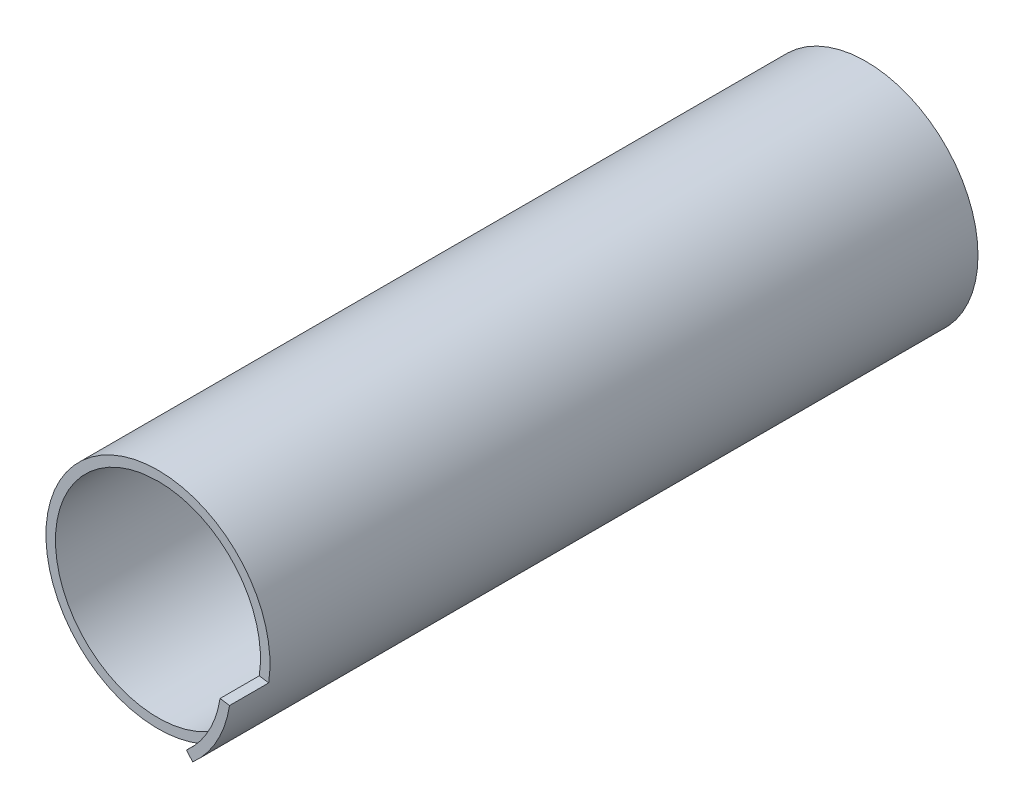
ISO-10303-21;
HEADER;
FILE_DESCRIPTION(('STEP AP214'),'2;1');
FILE_NAME('part.step','',(''),(''),'','','');
FILE_SCHEMA(('AUTOMOTIVE_DESIGN { 1 0 10303 214 1 1 1 1 }'));
ENDSEC;
DATA;
#1=APPLICATION_CONTEXT('core data for automotive mechanical design processes');
#2=APPLICATION_PROTOCOL_DEFINITION('international standard','automotive_design',2000,#1);
#3=PRODUCT_CONTEXT('',#1,'mechanical');
#4=PRODUCT('Part','Part','',(#3));
#5=PRODUCT_RELATED_PRODUCT_CATEGORY('part','',(#4));
#6=PRODUCT_DEFINITION_FORMATION('','',#4);
#7=PRODUCT_DEFINITION_CONTEXT('part definition',#1,'design');
#8=PRODUCT_DEFINITION('design','',#6,#7);
#9=PRODUCT_DEFINITION_SHAPE('','',#8);
#10=(LENGTH_UNIT() NAMED_UNIT(*) SI_UNIT(.MILLI.,.METRE.));
#11=(NAMED_UNIT(*) PLANE_ANGLE_UNIT() SI_UNIT($,.RADIAN.));
#12=(NAMED_UNIT(*) SI_UNIT($,.STERADIAN.) SOLID_ANGLE_UNIT());
#13=UNCERTAINTY_MEASURE_WITH_UNIT(LENGTH_MEASURE(1.E-05),#10,'distance_accuracy_value','');
#14=(GEOMETRIC_REPRESENTATION_CONTEXT(3) GLOBAL_UNCERTAINTY_ASSIGNED_CONTEXT((#13)) GLOBAL_UNIT_ASSIGNED_CONTEXT((#10,
#11,#12)) REPRESENTATION_CONTEXT('',''));
#15=CARTESIAN_POINT('',(0.,0.,0.));
#16=DIRECTION('',(0.,0.,1.));
#17=DIRECTION('',(1.,0.,0.));
#18=AXIS2_PLACEMENT_3D('',#15,#16,#17);
#19=CARTESIAN_POINT('',(0.,0.,0.));
#20=DIRECTION('',(0.,0.,-1.));
#21=DIRECTION('',(-1.,0.,0.));
#22=AXIS2_PLACEMENT_3D('',#19,#20,#21);
#23=PLANE('',#22);
#24=CARTESIAN_POINT('',(0.,0.,0.));
#25=DIRECTION('',(0.,0.,1.));
#26=DIRECTION('',(-1.,0.,0.));
#27=AXIS2_PLACEMENT_3D('',#24,#25,#26);
#28=CIRCLE('',#27,5.);
#29=CARTESIAN_POINT('',(-5.,0.,0.));
#30=VERTEX_POINT('',#29);
#31=CARTESIAN_POINT('',(5.,0.,0.));
#32=VERTEX_POINT('',#31);
#33=EDGE_CURVE('E102',#30,#32,#28,.T.);
#34=ORIENTED_EDGE('',*,*,#33,.F.);
#35=DIRECTION('',(0.,-1.,0.));
#36=VECTOR('',#35,1.);
#37=CARTESIAN_POINT('',(-5.,0.,0.));
#38=LINE('',#37,#36);
#39=CARTESIAN_POINT('',(-5.,16.5617028110035,0.));
#40=VERTEX_POINT('',#39);
#41=EDGE_CURVE('E56',#40,#30,#38,.T.);
#42=ORIENTED_EDGE('',*,*,#41,.F.);
#43=CARTESIAN_POINT('',(0.,0.,0.));
#44=DIRECTION('',(0.,0.,1.));
#45=DIRECTION('',(1.,0.,0.));
#46=AXIS2_PLACEMENT_3D('',#43,#44,#45);
#47=CIRCLE('',#46,17.3);
#48=CARTESIAN_POINT('',(5.,16.5617028110035,0.));
#49=VERTEX_POINT('',#48);
#50=EDGE_CURVE('E103',#49,#40,#47,.T.);
#51=ORIENTED_EDGE('',*,*,#50,.F.);
#52=DIRECTION('',(0.,1.,0.));
#53=VECTOR('',#52,1.);
#54=CARTESIAN_POINT('',(5.,0.,0.));
#55=LINE('',#54,#53);
#56=EDGE_CURVE('E92',#32,#49,#55,.T.);
#57=ORIENTED_EDGE('',*,*,#56,.F.);
#58=EDGE_LOOP('',(#34,#42,#51,#57));
#59=FACE_BOUND('',#58,.T.);
#60=CARTESIAN_POINT('',(0.,0.,0.));
#61=DIRECTION('',(0.,0.,1.));
#62=DIRECTION('',(1.,0.,0.));
#63=AXIS2_PLACEMENT_3D('',#60,#61,#62);
#64=CIRCLE('',#63,2.99999999999862);
#65=CARTESIAN_POINT('',(2.99999999999862,0.,0.));
#66=VERTEX_POINT('',#65);
#67=EDGE_CURVE('E115',#66,#66,#64,.T.);
#68=ORIENTED_EDGE('',*,*,#67,.T.);
#69=EDGE_LOOP('',(#68));
#70=FACE_BOUND('',#69,.T.);
#71=ADVANCED_FACE('F47',(#59,#70),#23,.T.);
#72=CARTESIAN_POINT('',(0.,0.,83.4395171801736));
#73=DIRECTION('',(0.,0.,-1.));
#74=DIRECTION('',(-1.,0.,0.));
#75=AXIS2_PLACEMENT_3D('',#72,#73,#74);
#76=CYLINDRICAL_SURFACE('',#75,5.);
#77=DIRECTION('',(0.,0.,-1.));
#78=VECTOR('',#77,1.);
#79=CARTESIAN_POINT('',(5.,0.,83.4395171801736));
#80=LINE('',#79,#78);
#81=CARTESIAN_POINT('',(5.,0.,58.6));
#82=VERTEX_POINT('',#81);
#83=EDGE_CURVE('E89',#82,#32,#80,.T.);
#84=ORIENTED_EDGE('',*,*,#83,.F.);
#85=CARTESIAN_POINT('',(0.,0.,58.6));
#86=DIRECTION('',(0.,0.,-1.));
#87=DIRECTION('',(-1.,0.,0.));
#88=AXIS2_PLACEMENT_3D('',#85,#86,#87);
#89=CIRCLE('',#88,5.);
#90=CARTESIAN_POINT('',(-5.,0.,58.6));
#91=VERTEX_POINT('',#90);
#92=EDGE_CURVE('E64',#82,#91,#89,.T.);
#93=ORIENTED_EDGE('',*,*,#92,.T.);
#94=DIRECTION('',(0.,0.,-1.));
#95=VECTOR('',#94,1.);
#96=CARTESIAN_POINT('',(-5.,0.,83.4395171801736));
#97=LINE('',#96,#95);
#98=EDGE_CURVE('E108',#91,#30,#97,.T.);
#99=ORIENTED_EDGE('',*,*,#98,.T.);
#100=ORIENTED_EDGE('',*,*,#33,.T.);
#101=EDGE_LOOP('',(#84,#93,#99,#100));
#102=FACE_BOUND('',#101,.T.);
#103=ADVANCED_FACE('F106',(#102),#76,.T.);
#104=CARTESIAN_POINT('',(5.,0.,83.4395171801736));
#105=DIRECTION('',(-1.,0.,0.));
#106=DIRECTION('',(0.,-1.,0.));
#107=AXIS2_PLACEMENT_3D('',#104,#105,#106);
#108=PLANE('',#107);
#109=DIRECTION('',(0.,0.,-1.));
#110=VECTOR('',#109,1.);
#111=CARTESIAN_POINT('',(5.,16.5617028110035,83.4395171801736));
#112=LINE('',#111,#110);
#113=CARTESIAN_POINT('',(5.,16.5617028110035,58.6));
#114=VERTEX_POINT('',#113);
#115=EDGE_CURVE('E84',#114,#49,#112,.T.);
#116=ORIENTED_EDGE('',*,*,#115,.F.);
#117=DIRECTION('',(0.,-1.,0.));
#118=VECTOR('',#117,1.);
#119=CARTESIAN_POINT('',(5.,0.,58.6));
#120=LINE('',#119,#118);
#121=EDGE_CURVE('E94',#114,#82,#120,.T.);
#122=ORIENTED_EDGE('',*,*,#121,.T.);
#123=ORIENTED_EDGE('',*,*,#83,.T.);
#124=ORIENTED_EDGE('',*,*,#56,.T.);
#125=EDGE_LOOP('',(#116,#122,#123,#124));
#126=FACE_BOUND('',#125,.T.);
#127=ADVANCED_FACE('F91',(#126),#108,.F.);
#128=CARTESIAN_POINT('',(0.,0.,83.4395171801736));
#129=DIRECTION('',(0.,0.,-1.));
#130=DIRECTION('',(-1.,0.,0.));
#131=AXIS2_PLACEMENT_3D('',#128,#129,#130);
#132=CYLINDRICAL_SURFACE('',#131,17.3);
#133=DIRECTION('',(0.,0.,-1.));
#134=VECTOR('',#133,1.);
#135=CARTESIAN_POINT('',(-5.,16.5617028110035,83.4395171801736));
#136=LINE('',#135,#134);
#137=CARTESIAN_POINT('',(-5.,16.5617028110035,58.6));
#138=VERTEX_POINT('',#137);
#139=EDGE_CURVE('E119',#138,#40,#136,.T.);
#140=ORIENTED_EDGE('',*,*,#139,.F.);
#141=CARTESIAN_POINT('',(0.,0.,58.6));
#142=DIRECTION('',(0.,0.,-1.));
#143=DIRECTION('',(-1.,0.,0.));
#144=AXIS2_PLACEMENT_3D('',#141,#142,#143);
#145=CIRCLE('',#144,17.3);
#146=EDGE_CURVE('E104',#138,#114,#145,.T.);
#147=ORIENTED_EDGE('',*,*,#146,.T.);
#148=ORIENTED_EDGE('',*,*,#115,.T.);
#149=ORIENTED_EDGE('',*,*,#50,.T.);
#150=EDGE_LOOP('',(#140,#147,#148,#149));
#151=FACE_BOUND('',#150,.T.);
#152=ADVANCED_FACE('F128',(#151),#132,.T.);
#153=CARTESIAN_POINT('',(-5.,0.,83.4395171801736));
#154=DIRECTION('',(1.,0.,0.));
#155=DIRECTION('',(0.,1.,0.));
#156=AXIS2_PLACEMENT_3D('',#153,#154,#155);
#157=PLANE('',#156);
#158=ORIENTED_EDGE('',*,*,#98,.F.);
#159=DIRECTION('',(0.,1.,0.));
#160=VECTOR('',#159,1.);
#161=CARTESIAN_POINT('',(-5.,0.,58.6));
#162=LINE('',#161,#160);
#163=EDGE_CURVE('E120',#91,#138,#162,.T.);
#164=ORIENTED_EDGE('',*,*,#163,.T.);
#165=ORIENTED_EDGE('',*,*,#139,.T.);
#166=ORIENTED_EDGE('',*,*,#41,.T.);
#167=EDGE_LOOP('',(#158,#164,#165,#166));
#168=FACE_BOUND('',#167,.T.);
#169=ADVANCED_FACE('F127',(#168),#157,.F.);
#170=CARTESIAN_POINT('',(0.,0.,83.4395171801736));
#171=DIRECTION('',(0.,0.,-1.));
#172=DIRECTION('',(-1.,0.,0.));
#173=AXIS2_PLACEMENT_3D('',#170,#171,#172);
#174=CYLINDRICAL_SURFACE('',#173,2.99999999999862);
#175=CARTESIAN_POINT('',(0.,0.,58.6));
#176=DIRECTION('',(0.,0.,-1.));
#177=DIRECTION('',(-1.,0.,0.));
#178=AXIS2_PLACEMENT_3D('',#175,#176,#177);
#179=CIRCLE('',#178,2.99999999999862);
#180=CARTESIAN_POINT('',(-2.99999999999862,0.,58.6));
#181=VERTEX_POINT('',#180);
#182=EDGE_CURVE('E13',#181,#181,#179,.T.);
#183=ORIENTED_EDGE('',*,*,#182,.F.);
#184=EDGE_LOOP('',(#183));
#185=FACE_BOUND('',#184,.T.);
#186=ORIENTED_EDGE('',*,*,#67,.F.);
#187=EDGE_LOOP('',(#186));
#188=FACE_BOUND('',#187,.T.);
#189=ADVANCED_FACE('F130',(#185,#188),#174,.F.);
#190=CARTESIAN_POINT('',(0.,0.,58.6));
#191=DIRECTION('',(0.,0.,-1.));
#192=DIRECTION('',(-1.,0.,0.));
#193=AXIS2_PLACEMENT_3D('',#190,#191,#192);
#194=PLANE('',#193);
#195=ORIENTED_EDGE('',*,*,#182,.T.);
#196=EDGE_LOOP('',(#195));
#197=FACE_BOUND('',#196,.T.);
#198=ORIENTED_EDGE('',*,*,#121,.F.);
#199=ORIENTED_EDGE('',*,*,#146,.F.);
#200=ORIENTED_EDGE('',*,*,#163,.F.);
#201=ORIENTED_EDGE('',*,*,#92,.F.);
#202=EDGE_LOOP('',(#198,#199,#200,#201));
#203=FACE_BOUND('',#202,.T.);
#204=ADVANCED_FACE('F49',(#197,#203),#194,.F.);
#205=CLOSED_SHELL('',(#71,#103,#127,#152,#169,#189,#204));
#206=MANIFOLD_SOLID_BREP('B2',#205);
#207=CARTESIAN_POINT('',(-7.42569141893252,8.1153624041562,126.4));
#208=DIRECTION('',(0.,0.,-1.));
#209=DIRECTION('',(-1.,0.,0.));
#210=AXIS2_PLACEMENT_3D('',#207,#208,#209);
#211=CYLINDRICAL_SURFACE('',#210,6.);
#212=CARTESIAN_POINT('',(-7.42569141893252,8.1153624041562,67.4));
#213=DIRECTION('',(0.,0.,-1.));
#214=DIRECTION('',(-1.,0.,0.));
#215=AXIS2_PLACEMENT_3D('',#212,#213,#214);
#216=CIRCLE('',#215,6.);
#217=CARTESIAN_POINT('',(-1.50631490724211,9.09565915149749,67.4));
#218=VERTEX_POINT('',#217);
#219=CARTESIAN_POINT('',(-3.37531428133296,3.68880109279827,67.4));
#220=VERTEX_POINT('',#219);
#221=EDGE_CURVE('E317',#218,#220,#216,.T.);
#222=ORIENTED_EDGE('',*,*,#221,.F.);
#223=DIRECTION('',(0.,0.,-1.));
#224=VECTOR('',#223,1.);
#225=CARTESIAN_POINT('',(-1.50631490724211,9.09565915149749,126.4));
#226=LINE('',#225,#224);
#227=CARTESIAN_POINT('',(-1.50631490724211,9.09565915149749,59.));
#228=VERTEX_POINT('',#227);
#229=EDGE_CURVE('E350',#218,#228,#226,.T.);
#230=ORIENTED_EDGE('',*,*,#229,.T.);
#231=CARTESIAN_POINT('',(-7.42569141893252,8.1153624041562,59.));
#232=DIRECTION('',(0.,0.,-1.));
#233=DIRECTION('',(-1.,0.,0.));
#234=AXIS2_PLACEMENT_3D('',#231,#232,#233);
#235=CIRCLE('',#234,6.);
#236=CARTESIAN_POINT('',(-3.37531428133296,3.68880109279827,59.));
#237=VERTEX_POINT('',#236);
#238=EDGE_CURVE('E338',#228,#237,#235,.T.);
#239=ORIENTED_EDGE('',*,*,#238,.T.);
#240=DIRECTION('',(0.,0.,-1.));
#241=VECTOR('',#240,1.);
#242=CARTESIAN_POINT('',(-3.37531428133296,3.68880109279827,126.4));
#243=LINE('',#242,#241);
#244=EDGE_CURVE('E351',#220,#237,#243,.T.);
#245=ORIENTED_EDGE('',*,*,#244,.F.);
#246=EDGE_LOOP('',(#222,#230,#239,#245));
#247=FACE_BOUND('',#246,.T.);
#248=ADVANCED_FACE('F193',(#247),#211,.F.);
#249=CARTESIAN_POINT('',(0.,0.,126.4));
#250=DIRECTION('',(0.,0.,-1.));
#251=DIRECTION('',(-1.,0.,0.));
#252=AXIS2_PLACEMENT_3D('',#249,#250,#251);
#253=CYLINDRICAL_SURFACE('',#252,5.);
#254=CARTESIAN_POINT('',(0.,0.,67.4));
#255=DIRECTION('',(0.,0.,-1.));
#256=DIRECTION('',(-1.,0.,0.));
#257=AXIS2_PLACEMENT_3D('',#254,#255,#256);
#258=CIRCLE('',#257,5.);
#259=CARTESIAN_POINT('',(2.72727272727273,4.19070202604222,67.4));
#260=VERTEX_POINT('',#259);
#261=EDGE_CURVE('E319',#220,#260,#258,.F.);
#262=ORIENTED_EDGE('',*,*,#261,.F.);
#263=ORIENTED_EDGE('',*,*,#244,.T.);
#264=CARTESIAN_POINT('',(0.,0.,59.));
#265=DIRECTION('',(0.,0.,-1.));
#266=DIRECTION('',(-1.,0.,0.));
#267=AXIS2_PLACEMENT_3D('',#264,#265,#266);
#268=CIRCLE('',#267,5.);
#269=CARTESIAN_POINT('',(2.72727272727273,4.19070202604222,59.));
#270=VERTEX_POINT('',#269);
#271=EDGE_CURVE('E341',#237,#270,#268,.F.);
#272=ORIENTED_EDGE('',*,*,#271,.T.);
#273=DIRECTION('',(0.,0.,-1.));
#274=VECTOR('',#273,1.);
#275=CARTESIAN_POINT('',(2.72727272727273,4.19070202604222,126.4));
#276=LINE('',#275,#274);
#277=EDGE_CURVE('E354',#260,#270,#276,.T.);
#278=ORIENTED_EDGE('',*,*,#277,.F.);
#279=EDGE_LOOP('',(#262,#263,#272,#278));
#280=FACE_BOUND('',#279,.T.);
#281=ADVANCED_FACE('F407',(#280),#253,.T.);
#282=CARTESIAN_POINT('',(6.,9.21954445729289,126.4));
#283=DIRECTION('',(0.,0.,-1.));
#284=DIRECTION('',(-1.,0.,0.));
#285=AXIS2_PLACEMENT_3D('',#282,#283,#284);
#286=CYLINDRICAL_SURFACE('',#285,6.);
#287=CARTESIAN_POINT('',(6.,9.21954445729289,67.4));
#288=DIRECTION('',(0.,0.,-1.));
#289=DIRECTION('',(-1.,0.,0.));
#290=AXIS2_PLACEMENT_3D('',#287,#288,#289);
#291=CIRCLE('',#290,6.);
#292=CARTESIAN_POINT('',(0.,9.21954445729289,67.4));
#293=VERTEX_POINT('',#292);
#294=EDGE_CURVE('E321',#260,#293,#291,.T.);
#295=ORIENTED_EDGE('',*,*,#294,.F.);
#296=ORIENTED_EDGE('',*,*,#277,.T.);
#297=CARTESIAN_POINT('',(6.,9.21954445729289,59.));
#298=DIRECTION('',(0.,0.,-1.));
#299=DIRECTION('',(-1.,0.,0.));
#300=AXIS2_PLACEMENT_3D('',#297,#298,#299);
#301=CIRCLE('',#300,6.);
#302=CARTESIAN_POINT('',(0.,9.21954445729289,59.));
#303=VERTEX_POINT('',#302);
#304=EDGE_CURVE('E344',#270,#303,#301,.T.);
#305=ORIENTED_EDGE('',*,*,#304,.T.);
#306=DIRECTION('',(0.,0.,-1.));
#307=VECTOR('',#306,1.);
#308=CARTESIAN_POINT('',(0.,9.21954445729289,126.4));
#309=LINE('',#308,#307);
#310=EDGE_CURVE('E356',#293,#303,#309,.T.);
#311=ORIENTED_EDGE('',*,*,#310,.F.);
#312=EDGE_LOOP('',(#295,#296,#305,#311));
#313=FACE_BOUND('',#312,.T.);
#314=ADVANCED_FACE('F402',(#313),#286,.F.);
#315=CARTESIAN_POINT('',(0.,18.3,126.4));
#316=DIRECTION('',(1.,0.,0.));
#317=DIRECTION('',(0.,1.,0.));
#318=AXIS2_PLACEMENT_3D('',#315,#316,#317);
#319=PLANE('',#318);
#320=DIRECTION('',(0.,1.,0.));
#321=VECTOR('',#320,1.);
#322=CARTESIAN_POINT('',(0.,18.3,67.4));
#323=LINE('',#322,#321);
#324=CARTESIAN_POINT('',(0.,18.3,67.4));
#325=VERTEX_POINT('',#324);
#326=EDGE_CURVE('E323',#293,#325,#323,.T.);
#327=ORIENTED_EDGE('',*,*,#326,.F.);
#328=ORIENTED_EDGE('',*,*,#310,.T.);
#329=DIRECTION('',(0.,1.,0.));
#330=VECTOR('',#329,1.);
#331=CARTESIAN_POINT('',(0.,18.3,59.));
#332=LINE('',#331,#330);
#333=CARTESIAN_POINT('',(0.,18.3,59.));
#334=VERTEX_POINT('',#333);
#335=EDGE_CURVE('E347',#303,#334,#332,.T.);
#336=ORIENTED_EDGE('',*,*,#335,.T.);
#337=DIRECTION('',(0.,0.,-1.));
#338=VECTOR('',#337,1.);
#339=CARTESIAN_POINT('',(0.,18.3,126.4));
#340=LINE('',#339,#338);
#341=EDGE_CURVE('E361',#325,#334,#340,.T.);
#342=ORIENTED_EDGE('',*,*,#341,.F.);
#343=EDGE_LOOP('',(#327,#328,#336,#342));
#344=FACE_BOUND('',#343,.T.);
#345=ADVANCED_FACE('F398',(#344),#319,.T.);
#346=CARTESIAN_POINT('',(-2.98990507939095,18.0540983606557,126.4));
#347=DIRECTION('',(-0.986562751948401,-0.163382791223549,0.));
#348=DIRECTION('',(0.163382791223549,-0.986562751948401,0.));
#349=AXIS2_PLACEMENT_3D('',#346,#347,#348);
#350=PLANE('',#349);
#351=DIRECTION('',(0.163382791223549,-0.986562751948401,0.));
#352=VECTOR('',#351,1.);
#353=CARTESIAN_POINT('',(-2.98990507939095,18.0540983606557,67.4));
#354=LINE('',#353,#352);
#355=CARTESIAN_POINT('',(-2.98990507939095,18.0540983606557,67.4));
#356=VERTEX_POINT('',#355);
#357=EDGE_CURVE('E315',#356,#218,#354,.T.);
#358=ORIENTED_EDGE('',*,*,#357,.F.);
#359=DIRECTION('',(0.,0.,-1.));
#360=VECTOR('',#359,1.);
#361=CARTESIAN_POINT('',(-2.98990507939095,18.0540983606557,126.4));
#362=LINE('',#361,#360);
#363=CARTESIAN_POINT('',(-2.98990507939095,18.0540983606557,59.));
#364=VERTEX_POINT('',#363);
#365=EDGE_CURVE('E364',#356,#364,#362,.T.);
#366=ORIENTED_EDGE('',*,*,#365,.T.);
#367=DIRECTION('',(0.163382791223549,-0.986562751948401,0.));
#368=VECTOR('',#367,1.);
#369=CARTESIAN_POINT('',(-2.98990507939095,18.0540983606557,59.));
#370=LINE('',#369,#368);
#371=EDGE_CURVE('E335',#364,#228,#370,.T.);
#372=ORIENTED_EDGE('',*,*,#371,.T.);
#373=ORIENTED_EDGE('',*,*,#229,.F.);
#374=EDGE_LOOP('',(#358,#366,#372,#373));
#375=FACE_BOUND('',#374,.T.);
#376=ADVANCED_FACE('F414',(#375),#350,.T.);
#377=CARTESIAN_POINT('',(0.,0.,126.4));
#378=DIRECTION('',(0.,0.,-1.));
#379=DIRECTION('',(-1.,0.,0.));
#380=AXIS2_PLACEMENT_3D('',#377,#378,#379);
#381=CYLINDRICAL_SURFACE('',#380,3.);
#382=CARTESIAN_POINT('',(0.,0.,67.4));
#383=DIRECTION('',(0.,0.,-1.));
#384=DIRECTION('',(-1.,0.,0.));
#385=AXIS2_PLACEMENT_3D('',#382,#383,#384);
#386=CIRCLE('',#385,3.);
#387=CARTESIAN_POINT('',(-3.,0.,67.4));
#388=VERTEX_POINT('',#387);
#389=EDGE_CURVE('E311',#388,#388,#386,.F.);
#390=ORIENTED_EDGE('',*,*,#389,.T.);
#391=EDGE_LOOP('',(#390));
#392=FACE_BOUND('',#391,.T.);
#393=CARTESIAN_POINT('',(0.,0.,59.));
#394=DIRECTION('',(0.,0.,-1.));
#395=DIRECTION('',(-1.,0.,0.));
#396=AXIS2_PLACEMENT_3D('',#393,#394,#395);
#397=CIRCLE('',#396,3.);
#398=CARTESIAN_POINT('',(-3.,0.,59.));
#399=VERTEX_POINT('',#398);
#400=EDGE_CURVE('E197',#399,#399,#397,.F.);
#401=ORIENTED_EDGE('',*,*,#400,.F.);
#402=EDGE_LOOP('',(#401));
#403=FACE_BOUND('',#402,.T.);
#404=ADVANCED_FACE('F439',(#392,#403),#381,.F.);
#405=CARTESIAN_POINT('',(0.,0.,126.4));
#406=DIRECTION('',(0.,0.,1.));
#407=DIRECTION('',(1.,0.,0.));
#408=AXIS2_PLACEMENT_3D('',#405,#406,#407);
#409=PLANE('',#408);
#410=DIRECTION('',(0.660263868399651,-0.751033703695066,0.));
#411=VECTOR('',#410,1.);
#412=CARTESIAN_POINT('',(13.205277367993,-15.0206740739013,126.4));
#413=LINE('',#412,#411);
#414=CARTESIAN_POINT('',(12.0828287917136,-13.7439167776197,126.4));
#415=VERTEX_POINT('',#414);
#416=CARTESIAN_POINT('',(13.205277367993,-15.0206740739013,126.4));
#417=VERTEX_POINT('',#416);
#418=EDGE_CURVE('E299',#415,#417,#413,.T.);
#419=ORIENTED_EDGE('',*,*,#418,.F.);
#420=CARTESIAN_POINT('',(0.,0.,126.4));
#421=DIRECTION('',(0.,0.,1.));
#422=DIRECTION('',(1.,0.,0.));
#423=AXIS2_PLACEMENT_3D('',#420,#421,#422);
#424=CIRCLE('',#423,18.3);
#425=CARTESIAN_POINT('',(-2.98990507939095,18.0540983606557,126.4));
#426=VERTEX_POINT('',#425);
#427=EDGE_CURVE('E366',#426,#415,#424,.T.);
#428=ORIENTED_EDGE('',*,*,#427,.F.);
#429=DIRECTION('',(-0.99663502646365,-0.0819672131147538,0.));
#430=VECTOR('',#429,1.);
#431=CARTESIAN_POINT('',(0.,18.3,126.4));
#432=LINE('',#431,#430);
#433=CARTESIAN_POINT('',(0.,18.3,126.4));
#434=VERTEX_POINT('',#433);
#435=EDGE_CURVE('E302',#434,#426,#432,.T.);
#436=ORIENTED_EDGE('',*,*,#435,.F.);
#437=CARTESIAN_POINT('',(18.0904032662671,-2.76175843690796,126.4));
#438=VERTEX_POINT('',#437);
#439=EDGE_CURVE('E369',#438,#434,#424,.T.);
#440=ORIENTED_EDGE('',*,*,#439,.F.);
#441=DIRECTION('',(-0.988546626571973,0.15091576157967,0.));
#442=VECTOR('',#441,1.);
#443=CARTESIAN_POINT('',(19.7709325314395,-3.0183152315934,126.4));
#444=LINE('',#443,#442);
#445=CARTESIAN_POINT('',(19.7709325314395,-3.0183152315934,126.4));
#446=VERTEX_POINT('',#445);
#447=EDGE_CURVE('E209',#446,#438,#444,.T.);
#448=ORIENTED_EDGE('',*,*,#447,.F.);
#449=CARTESIAN_POINT('',(0.,0.,126.4));
#450=DIRECTION('',(0.,0.,1.));
#451=DIRECTION('',(1.,0.,0.));
#452=AXIS2_PLACEMENT_3D('',#449,#450,#451);
#453=CIRCLE('',#452,20.);
#454=EDGE_CURVE('E45',#446,#417,#453,.T.);
#455=ORIENTED_EDGE('',*,*,#454,.T.);
#456=EDGE_LOOP('',(#419,#428,#436,#440,#448,#455));
#457=FACE_BOUND('',#456,.T.);
#458=ADVANCED_FACE('F377',(#457),#409,.T.);
#459=CARTESIAN_POINT('',(0.,0.,0.));
#460=DIRECTION('',(0.,0.,1.));
#461=DIRECTION('',(1.,0.,0.));
#462=AXIS2_PLACEMENT_3D('',#459,#460,#461);
#463=PLANE('',#462);
#464=CARTESIAN_POINT('',(0.,0.,0.));
#465=DIRECTION('',(0.,0.,1.));
#466=DIRECTION('',(1.,0.,0.));
#467=AXIS2_PLACEMENT_3D('',#464,#465,#466);
#468=CIRCLE('',#467,20.);
#469=CARTESIAN_POINT('',(20.,0.,0.));
#470=VERTEX_POINT('',#469);
#471=EDGE_CURVE('E202',#470,#470,#468,.T.);
#472=ORIENTED_EDGE('',*,*,#471,.F.);
#473=EDGE_LOOP('',(#472));
#474=FACE_BOUND('',#473,.T.);
#475=CARTESIAN_POINT('',(0.,0.,0.));
#476=DIRECTION('',(0.,0.,1.));
#477=DIRECTION('',(1.,0.,0.));
#478=AXIS2_PLACEMENT_3D('',#475,#476,#477);
#479=CIRCLE('',#478,18.3);
#480=CARTESIAN_POINT('',(-2.98990507939095,18.0540983606557,0.));
#481=VERTEX_POINT('',#480);
#482=CARTESIAN_POINT('',(0.,18.3,0.));
#483=VERTEX_POINT('',#482);
#484=EDGE_CURVE('E353',#481,#483,#479,.T.);
#485=ORIENTED_EDGE('',*,*,#484,.T.);
#486=DIRECTION('',(0.99663502646365,0.0819672131147538,0.));
#487=VECTOR('',#486,1.);
#488=CARTESIAN_POINT('',(0.,18.3,0.));
#489=LINE('',#488,#487);
#490=EDGE_CURVE('E325',#481,#483,#489,.T.);
#491=ORIENTED_EDGE('',*,*,#490,.F.);
#492=EDGE_LOOP('',(#485,#491));
#493=FACE_BOUND('',#492,.T.);
#494=ADVANCED_FACE('F374',(#474,#493),#463,.F.);
#495=CARTESIAN_POINT('',(0.,0.,126.4));
#496=DIRECTION('',(0.,0.,-1.));
#497=DIRECTION('',(-1.,0.,0.));
#498=AXIS2_PLACEMENT_3D('',#495,#496,#497);
#499=CYLINDRICAL_SURFACE('',#498,20.);
#500=ORIENTED_EDGE('',*,*,#454,.F.);
#501=DIRECTION('',(0.,0.,-1.));
#502=VECTOR('',#501,1.);
#503=CARTESIAN_POINT('',(19.7709325314395,-3.0183152315934,133.4));
#504=LINE('',#503,#502);
#505=CARTESIAN_POINT('',(19.7709325314395,-3.0183152315934,133.4));
#506=VERTEX_POINT('',#505);
#507=EDGE_CURVE('E284',#506,#446,#504,.T.);
#508=ORIENTED_EDGE('',*,*,#507,.F.);
#509=CARTESIAN_POINT('',(0.,0.,133.4));
#510=DIRECTION('',(0.,0.,1.));
#511=DIRECTION('',(-1.,0.,0.));
#512=AXIS2_PLACEMENT_3D('',#509,#510,#511);
#513=CIRCLE('',#512,20.);
#514=CARTESIAN_POINT('',(13.205277367993,-15.0206740739013,133.4));
#515=VERTEX_POINT('',#514);
#516=EDGE_CURVE('E290',#515,#506,#513,.T.);
#517=ORIENTED_EDGE('',*,*,#516,.F.);
#518=DIRECTION('',(0.,0.,-1.));
#519=VECTOR('',#518,1.);
#520=CARTESIAN_POINT('',(13.205277367993,-15.0206740739013,133.4));
#521=LINE('',#520,#519);
#522=EDGE_CURVE('E427',#515,#417,#521,.T.);
#523=ORIENTED_EDGE('',*,*,#522,.T.);
#524=EDGE_LOOP('',(#500,#508,#517,#523));
#525=FACE_BOUND('',#524,.T.);
#526=ORIENTED_EDGE('',*,*,#471,.T.);
#527=EDGE_LOOP('',(#526));
#528=FACE_BOUND('',#527,.T.);
#529=ADVANCED_FACE('F195',(#525,#528),#499,.T.);
#530=CARTESIAN_POINT('',(0.,0.,126.4));
#531=DIRECTION('',(0.,0.,-1.));
#532=DIRECTION('',(-1.,0.,0.));
#533=AXIS2_PLACEMENT_3D('',#530,#531,#532);
#534=CYLINDRICAL_SURFACE('',#533,18.3);
#535=ORIENTED_EDGE('',*,*,#365,.F.);
#536=EDGE_CURVE('E362',#426,#356,#362,.T.);
#537=ORIENTED_EDGE('',*,*,#536,.F.);
#538=ORIENTED_EDGE('',*,*,#427,.T.);
#539=DIRECTION('',(0.,0.,-1.));
#540=VECTOR('',#539,1.);
#541=CARTESIAN_POINT('',(12.0828287917136,-13.7439167776197,133.4));
#542=LINE('',#541,#540);
#543=CARTESIAN_POINT('',(12.0828287917136,-13.7439167776197,133.4));
#544=VERTEX_POINT('',#543);
#545=EDGE_CURVE('E306',#544,#415,#542,.T.);
#546=ORIENTED_EDGE('',*,*,#545,.F.);
#547=CARTESIAN_POINT('',(0.,0.,133.4));
#548=DIRECTION('',(0.,0.,-1.));
#549=DIRECTION('',(-1.,0.,0.));
#550=AXIS2_PLACEMENT_3D('',#547,#548,#549);
#551=CIRCLE('',#550,18.3);
#552=CARTESIAN_POINT('',(18.0904032662671,-2.76175843690796,133.4));
#553=VERTEX_POINT('',#552);
#554=EDGE_CURVE('E289',#553,#544,#551,.T.);
#555=ORIENTED_EDGE('',*,*,#554,.F.);
#556=DIRECTION('',(0.,0.,-1.));
#557=VECTOR('',#556,1.);
#558=CARTESIAN_POINT('',(18.0904032662671,-2.76175843690796,133.4));
#559=LINE('',#558,#557);
#560=EDGE_CURVE('E286',#553,#438,#559,.T.);
#561=ORIENTED_EDGE('',*,*,#560,.T.);
#562=ORIENTED_EDGE('',*,*,#439,.T.);
#563=EDGE_CURVE('E358',#434,#325,#340,.T.);
#564=ORIENTED_EDGE('',*,*,#563,.T.);
#565=ORIENTED_EDGE('',*,*,#341,.T.);
#566=DIRECTION('',(0.,0.,-1.));
#567=VECTOR('',#566,1.);
#568=CARTESIAN_POINT('',(0.,18.3,59.));
#569=LINE('',#568,#567);
#570=EDGE_CURVE('E331',#334,#483,#569,.T.);
#571=ORIENTED_EDGE('',*,*,#570,.T.);
#572=ORIENTED_EDGE('',*,*,#484,.F.);
#573=DIRECTION('',(0.,0.,-1.));
#574=VECTOR('',#573,1.);
#575=CARTESIAN_POINT('',(-2.98990507939095,18.0540983606557,59.));
#576=LINE('',#575,#574);
#577=EDGE_CURVE('E329',#364,#481,#576,.T.);
#578=ORIENTED_EDGE('',*,*,#577,.F.);
#579=EDGE_LOOP('',(#535,#537,#538,#546,#555,#561,#562,#564,#565,#571,#572,#578));
#580=FACE_BOUND('',#579,.T.);
#581=ADVANCED_FACE('F383',(#580),#534,.F.);
#582=CARTESIAN_POINT('',(0.,0.,59.));
#583=DIRECTION('',(0.,0.,-1.));
#584=DIRECTION('',(-1.,0.,0.));
#585=AXIS2_PLACEMENT_3D('',#582,#583,#584);
#586=PLANE('',#585);
#587=ORIENTED_EDGE('',*,*,#304,.F.);
#588=ORIENTED_EDGE('',*,*,#271,.F.);
#589=ORIENTED_EDGE('',*,*,#238,.F.);
#590=ORIENTED_EDGE('',*,*,#371,.F.);
#591=DIRECTION('',(0.99663502646365,0.0819672131147538,0.));
#592=VECTOR('',#591,1.);
#593=CARTESIAN_POINT('',(0.,18.3,59.));
#594=LINE('',#593,#592);
#595=EDGE_CURVE('E326',#364,#334,#594,.T.);
#596=ORIENTED_EDGE('',*,*,#595,.T.);
#597=ORIENTED_EDGE('',*,*,#335,.F.);
#598=EDGE_LOOP('',(#587,#588,#589,#590,#596,#597));
#599=FACE_BOUND('',#598,.T.);
#600=ORIENTED_EDGE('',*,*,#400,.T.);
#601=EDGE_LOOP('',(#600));
#602=FACE_BOUND('',#601,.T.);
#603=ADVANCED_FACE('F393',(#599,#602),#586,.T.);
#604=CARTESIAN_POINT('',(0.,18.3,59.));
#605=DIRECTION('',(-0.0819672131147538,0.99663502646365,0.));
#606=DIRECTION('',(-0.99663502646365,-0.0819672131147538,0.));
#607=AXIS2_PLACEMENT_3D('',#604,#605,#606);
#608=PLANE('',#607);
#609=ORIENTED_EDGE('',*,*,#490,.T.);
#610=ORIENTED_EDGE('',*,*,#570,.F.);
#611=ORIENTED_EDGE('',*,*,#595,.F.);
#612=ORIENTED_EDGE('',*,*,#577,.T.);
#613=EDGE_LOOP('',(#609,#610,#611,#612));
#614=FACE_BOUND('',#613,.T.);
#615=ADVANCED_FACE('F388',(#614),#608,.F.);
#616=CARTESIAN_POINT('',(0.,0.,67.4));
#617=DIRECTION('',(0.,0.,-1.));
#618=DIRECTION('',(-1.,0.,0.));
#619=AXIS2_PLACEMENT_3D('',#616,#617,#618);
#620=PLANE('',#619);
#621=ORIENTED_EDGE('',*,*,#326,.T.);
#622=DIRECTION('',(-0.99663502646365,-0.0819672131147538,0.));
#623=VECTOR('',#622,1.);
#624=CARTESIAN_POINT('',(0.,18.3,67.4));
#625=LINE('',#624,#623);
#626=EDGE_CURVE('E304',#325,#356,#625,.T.);
#627=ORIENTED_EDGE('',*,*,#626,.T.);
#628=ORIENTED_EDGE('',*,*,#357,.T.);
#629=ORIENTED_EDGE('',*,*,#221,.T.);
#630=ORIENTED_EDGE('',*,*,#261,.T.);
#631=ORIENTED_EDGE('',*,*,#294,.T.);
#632=EDGE_LOOP('',(#621,#627,#628,#629,#630,#631));
#633=FACE_BOUND('',#632,.T.);
#634=ORIENTED_EDGE('',*,*,#389,.F.);
#635=EDGE_LOOP('',(#634));
#636=FACE_BOUND('',#635,.T.);
#637=ADVANCED_FACE('F433',(#633,#636),#620,.F.);
#638=CARTESIAN_POINT('',(0.,18.3,67.4));
#639=DIRECTION('',(-0.0819672131147538,0.99663502646365,0.));
#640=DIRECTION('',(-0.99663502646365,-0.0819672131147538,0.));
#641=AXIS2_PLACEMENT_3D('',#638,#639,#640);
#642=PLANE('',#641);
#643=ORIENTED_EDGE('',*,*,#435,.T.);
#644=ORIENTED_EDGE('',*,*,#536,.T.);
#645=ORIENTED_EDGE('',*,*,#626,.F.);
#646=ORIENTED_EDGE('',*,*,#563,.F.);
#647=EDGE_LOOP('',(#643,#644,#645,#646));
#648=FACE_BOUND('',#647,.T.);
#649=ADVANCED_FACE('F431',(#648),#642,.F.);
#650=CARTESIAN_POINT('',(19.7709325314395,-3.0183152315934,133.4));
#651=DIRECTION('',(-0.15091576157967,-0.988546626571973,0.));
#652=DIRECTION('',(0.988546626571973,-0.15091576157967,0.));
#653=AXIS2_PLACEMENT_3D('',#650,#651,#652);
#654=PLANE('',#653);
#655=ORIENTED_EDGE('',*,*,#447,.T.);
#656=ORIENTED_EDGE('',*,*,#560,.F.);
#657=DIRECTION('',(-0.988546626571973,0.15091576157967,0.));
#658=VECTOR('',#657,1.);
#659=CARTESIAN_POINT('',(19.7709325314395,-3.0183152315934,133.4));
#660=LINE('',#659,#658);
#661=EDGE_CURVE('E280',#506,#553,#660,.T.);
#662=ORIENTED_EDGE('',*,*,#661,.F.);
#663=ORIENTED_EDGE('',*,*,#507,.T.);
#664=EDGE_LOOP('',(#655,#656,#662,#663));
#665=FACE_BOUND('',#664,.T.);
#666=ADVANCED_FACE('F282',(#665),#654,.F.);
#667=CARTESIAN_POINT('',(13.205277367993,-15.0206740739013,133.4));
#668=DIRECTION('',(0.751033703695066,0.660263868399651,0.));
#669=DIRECTION('',(-0.660263868399652,0.751033703695066,0.));
#670=AXIS2_PLACEMENT_3D('',#667,#668,#669);
#671=PLANE('',#670);
#672=ORIENTED_EDGE('',*,*,#418,.T.);
#673=ORIENTED_EDGE('',*,*,#522,.F.);
#674=DIRECTION('',(0.660263868399651,-0.751033703695066,0.));
#675=VECTOR('',#674,1.);
#676=CARTESIAN_POINT('',(13.205277367993,-15.0206740739013,133.4));
#677=LINE('',#676,#675);
#678=EDGE_CURVE('E295',#544,#515,#677,.T.);
#679=ORIENTED_EDGE('',*,*,#678,.F.);
#680=ORIENTED_EDGE('',*,*,#545,.T.);
#681=EDGE_LOOP('',(#672,#673,#679,#680));
#682=FACE_BOUND('',#681,.T.);
#683=ADVANCED_FACE('F428',(#682),#671,.F.);
#684=CARTESIAN_POINT('',(0.,0.,133.4));
#685=DIRECTION('',(0.,0.,-1.));
#686=DIRECTION('',(-1.,0.,0.));
#687=AXIS2_PLACEMENT_3D('',#684,#685,#686);
#688=PLANE('',#687);
#689=ORIENTED_EDGE('',*,*,#516,.T.);
#690=ORIENTED_EDGE('',*,*,#661,.T.);
#691=ORIENTED_EDGE('',*,*,#554,.T.);
#692=ORIENTED_EDGE('',*,*,#678,.T.);
#693=EDGE_LOOP('',(#689,#690,#691,#692));
#694=FACE_BOUND('',#693,.T.);
#695=ADVANCED_FACE('F293',(#694),#688,.F.);
#696=CLOSED_SHELL('',(#248,#281,#314,#345,#376,#404,#458,#494,#529,#581,#603,#615,#637,#649,
#666,#683,#695));
#697=MANIFOLD_SOLID_BREP('B7',#696);
#698=ADVANCED_BREP_SHAPE_REPRESENTATION('',(#18,#206,#697),#14);
#699=SHAPE_DEFINITION_REPRESENTATION(#9,#698);
ENDSEC;
END-ISO-10303-21;
